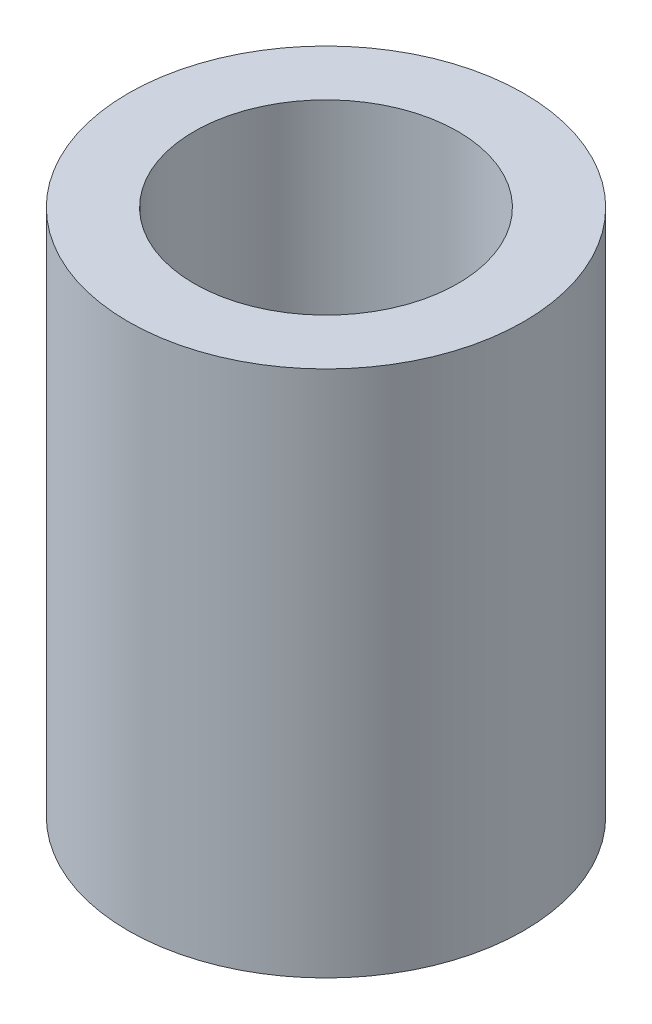
ISO-10303-21;
HEADER;
FILE_DESCRIPTION(('STEP AP214'),'2;1');
FILE_NAME('part.step','',(''),(''),'','','');
FILE_SCHEMA(('AUTOMOTIVE_DESIGN { 1 0 10303 214 1 1 1 1 }'));
ENDSEC;
DATA;
#1=APPLICATION_CONTEXT('core data for automotive mechanical design processes');
#2=APPLICATION_PROTOCOL_DEFINITION('international standard','automotive_design',2000,#1);
#3=PRODUCT_CONTEXT('',#1,'mechanical');
#4=PRODUCT('Part','Part','',(#3));
#5=PRODUCT_RELATED_PRODUCT_CATEGORY('part','',(#4));
#6=PRODUCT_DEFINITION_FORMATION('','',#4);
#7=PRODUCT_DEFINITION_CONTEXT('part definition',#1,'design');
#8=PRODUCT_DEFINITION('design','',#6,#7);
#9=PRODUCT_DEFINITION_SHAPE('','',#8);
#10=(LENGTH_UNIT() NAMED_UNIT(*) SI_UNIT(.MILLI.,.METRE.));
#11=(NAMED_UNIT(*) PLANE_ANGLE_UNIT() SI_UNIT($,.RADIAN.));
#12=(NAMED_UNIT(*) SI_UNIT($,.STERADIAN.) SOLID_ANGLE_UNIT());
#13=UNCERTAINTY_MEASURE_WITH_UNIT(LENGTH_MEASURE(1.E-05),#10,'distance_accuracy_value','');
#14=(GEOMETRIC_REPRESENTATION_CONTEXT(3) GLOBAL_UNCERTAINTY_ASSIGNED_CONTEXT((#13)) GLOBAL_UNIT_ASSIGNED_CONTEXT((#10,
#11,#12)) REPRESENTATION_CONTEXT('',''));
#15=CARTESIAN_POINT('',(0.,0.,0.));
#16=DIRECTION('',(0.,0.,1.));
#17=DIRECTION('',(1.,0.,0.));
#18=AXIS2_PLACEMENT_3D('',#15,#16,#17);
#19=CARTESIAN_POINT('',(0.,6.,0.));
#20=DIRECTION('',(0.,1.,0.));
#21=DIRECTION('',(0.,0.,1.));
#22=AXIS2_PLACEMENT_3D('',#19,#20,#21);
#23=PLANE('',#22);
#24=CARTESIAN_POINT('',(0.,6.,0.));
#25=DIRECTION('',(0.,1.,0.));
#26=DIRECTION('',(0.,0.,1.));
#27=AXIS2_PLACEMENT_3D('',#24,#25,#26);
#28=CIRCLE('',#27,2.25);
#29=CARTESIAN_POINT('',(0.,6.,2.25));
#30=VERTEX_POINT('',#29);
#31=EDGE_CURVE('E10',#30,#30,#28,.T.);
#32=ORIENTED_EDGE('',*,*,#31,.T.);
#33=EDGE_LOOP('',(#32));
#34=FACE_BOUND('',#33,.T.);
#35=CARTESIAN_POINT('',(0.,6.,0.));
#36=DIRECTION('',(0.,1.,0.));
#37=DIRECTION('',(0.,0.,1.));
#38=AXIS2_PLACEMENT_3D('',#35,#36,#37);
#39=CIRCLE('',#38,1.5);
#40=CARTESIAN_POINT('',(0.,6.,1.5));
#41=VERTEX_POINT('',#40);
#42=EDGE_CURVE('E56',#41,#41,#39,.T.);
#43=ORIENTED_EDGE('',*,*,#42,.F.);
#44=EDGE_LOOP('',(#43));
#45=FACE_BOUND('',#44,.T.);
#46=ADVANCED_FACE('F43',(#34,#45),#23,.T.);
#47=CARTESIAN_POINT('',(0.,0.,0.));
#48=DIRECTION('',(0.,1.,0.));
#49=DIRECTION('',(0.,0.,1.));
#50=AXIS2_PLACEMENT_3D('',#47,#48,#49);
#51=PLANE('',#50);
#52=CARTESIAN_POINT('',(0.,0.,0.));
#53=DIRECTION('',(0.,1.,0.));
#54=DIRECTION('',(0.,0.,1.));
#55=AXIS2_PLACEMENT_3D('',#52,#53,#54);
#56=CIRCLE('',#55,2.25);
#57=CARTESIAN_POINT('',(0.,0.,2.25));
#58=VERTEX_POINT('',#57);
#59=EDGE_CURVE('E47',#58,#58,#56,.T.);
#60=ORIENTED_EDGE('',*,*,#59,.F.);
#61=EDGE_LOOP('',(#60));
#62=FACE_BOUND('',#61,.T.);
#63=CARTESIAN_POINT('',(0.,0.,0.));
#64=DIRECTION('',(0.,1.,0.));
#65=DIRECTION('',(0.,0.,1.));
#66=AXIS2_PLACEMENT_3D('',#63,#64,#65);
#67=CIRCLE('',#66,1.5);
#68=CARTESIAN_POINT('',(0.,0.,1.5));
#69=VERTEX_POINT('',#68);
#70=EDGE_CURVE('E58',#69,#69,#67,.T.);
#71=ORIENTED_EDGE('',*,*,#70,.T.);
#72=EDGE_LOOP('',(#71));
#73=FACE_BOUND('',#72,.T.);
#74=ADVANCED_FACE('F70',(#62,#73),#51,.F.);
#75=CARTESIAN_POINT('',(0.,6.,0.));
#76=DIRECTION('',(0.,-1.,0.));
#77=DIRECTION('',(0.,0.,-1.));
#78=AXIS2_PLACEMENT_3D('',#75,#76,#77);
#79=CYLINDRICAL_SURFACE('',#78,2.25);
#80=ORIENTED_EDGE('',*,*,#31,.F.);
#81=EDGE_LOOP('',(#80));
#82=FACE_BOUND('',#81,.T.);
#83=ORIENTED_EDGE('',*,*,#59,.T.);
#84=EDGE_LOOP('',(#83));
#85=FACE_BOUND('',#84,.T.);
#86=ADVANCED_FACE('F45',(#82,#85),#79,.T.);
#87=CARTESIAN_POINT('',(0.,6.,0.));
#88=DIRECTION('',(0.,-1.,0.));
#89=DIRECTION('',(0.,0.,-1.));
#90=AXIS2_PLACEMENT_3D('',#87,#88,#89);
#91=CYLINDRICAL_SURFACE('',#90,1.5);
#92=ORIENTED_EDGE('',*,*,#42,.T.);
#93=EDGE_LOOP('',(#92));
#94=FACE_BOUND('',#93,.T.);
#95=ORIENTED_EDGE('',*,*,#70,.F.);
#96=EDGE_LOOP('',(#95));
#97=FACE_BOUND('',#96,.T.);
#98=ADVANCED_FACE('F66',(#94,#97),#91,.F.);
#99=CLOSED_SHELL('',(#46,#74,#86,#98));
#100=MANIFOLD_SOLID_BREP('B2',#99);
#101=ADVANCED_BREP_SHAPE_REPRESENTATION('',(#18,#100),#14);
#102=SHAPE_DEFINITION_REPRESENTATION(#9,#101);
ENDSEC;
END-ISO-10303-21;
